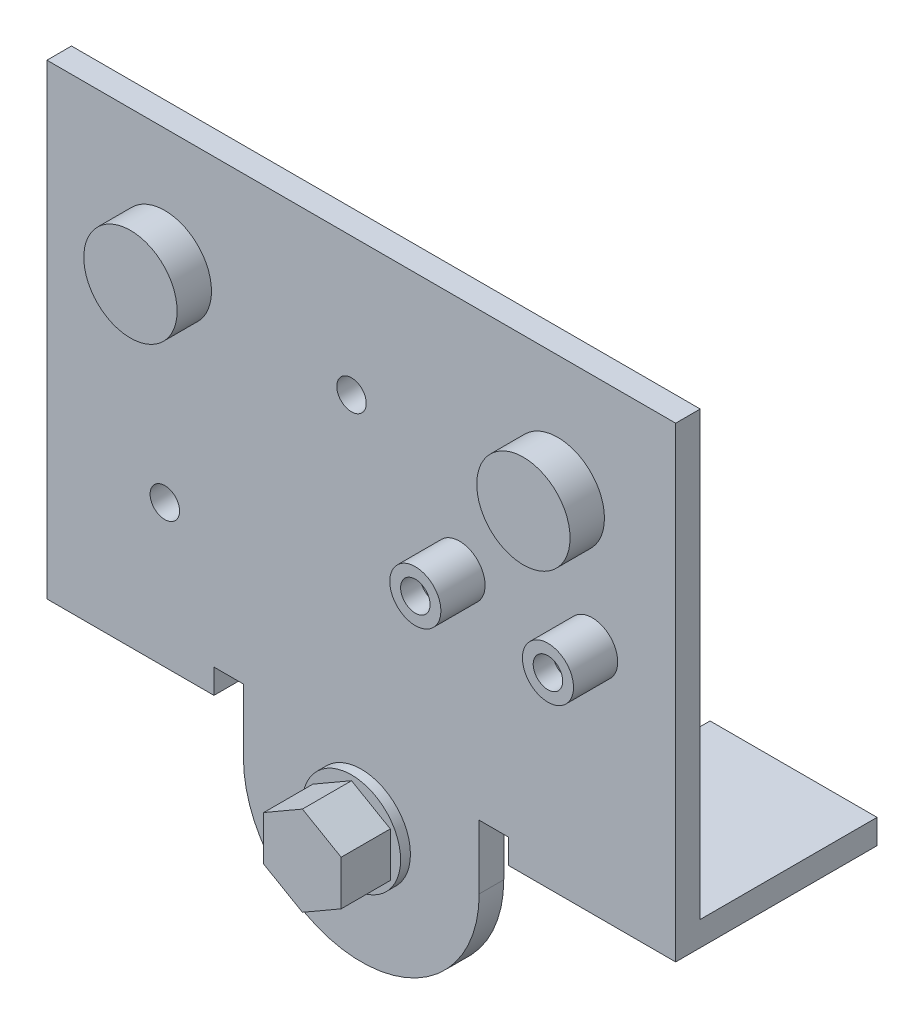
ISO-10303-21;
HEADER;
FILE_DESCRIPTION(('STEP AP214'),'2;1');
FILE_NAME('part.step','',(''),(''),'','','');
FILE_SCHEMA(('AUTOMOTIVE_DESIGN { 1 0 10303 214 1 1 1 1 }'));
ENDSEC;
DATA;
#1=APPLICATION_CONTEXT('core data for automotive mechanical design processes');
#2=APPLICATION_PROTOCOL_DEFINITION('international standard','automotive_design',2000,#1);
#3=PRODUCT_CONTEXT('',#1,'mechanical');
#4=PRODUCT('Part','Part','',(#3));
#5=PRODUCT_RELATED_PRODUCT_CATEGORY('part','',(#4));
#6=PRODUCT_DEFINITION_FORMATION('','',#4);
#7=PRODUCT_DEFINITION_CONTEXT('part definition',#1,'design');
#8=PRODUCT_DEFINITION('design','',#6,#7);
#9=PRODUCT_DEFINITION_SHAPE('','',#8);
#10=(LENGTH_UNIT() NAMED_UNIT(*) SI_UNIT(.MILLI.,.METRE.));
#11=(NAMED_UNIT(*) PLANE_ANGLE_UNIT() SI_UNIT($,.RADIAN.));
#12=(NAMED_UNIT(*) SI_UNIT($,.STERADIAN.) SOLID_ANGLE_UNIT());
#13=UNCERTAINTY_MEASURE_WITH_UNIT(LENGTH_MEASURE(1.E-05),#10,'distance_accuracy_value','');
#14=(GEOMETRIC_REPRESENTATION_CONTEXT(3) GLOBAL_UNCERTAINTY_ASSIGNED_CONTEXT((#13)) GLOBAL_UNIT_ASSIGNED_CONTEXT((#10,
#11,#12)) REPRESENTATION_CONTEXT('',''));
#15=CARTESIAN_POINT('',(0.,0.,0.));
#16=DIRECTION('',(0.,0.,1.));
#17=DIRECTION('',(1.,0.,0.));
#18=AXIS2_PLACEMENT_3D('',#15,#16,#17);
#19=CARTESIAN_POINT('',(-32.,-25.1480637813212,2.5));
#20=DIRECTION('',(0.,1.,0.));
#21=DIRECTION('',(0.,0.,1.));
#22=AXIS2_PLACEMENT_3D('',#19,#20,#21);
#23=PLANE('',#22);
#24=DIRECTION('',(1.,0.,0.));
#25=VECTOR('',#24,1.);
#26=CARTESIAN_POINT('',(-32.,-25.1480637813212,2.5));
#27=LINE('',#26,#25);
#28=CARTESIAN_POINT('',(12.,-25.1480637813212,2.5));
#29=VERTEX_POINT('',#28);
#30=CARTESIAN_POINT('',(15.,-25.1480637813212,2.5));
#31=VERTEX_POINT('',#30);
#32=EDGE_CURVE('E297',#29,#31,#27,.T.);
#33=ORIENTED_EDGE('',*,*,#32,.F.);
#34=DIRECTION('',(0.,0.,1.));
#35=VECTOR('',#34,1.);
#36=CARTESIAN_POINT('',(12.,-25.1480637813212,0.));
#37=LINE('',#36,#35);
#38=CARTESIAN_POINT('',(12.,-25.1480637813212,0.));
#39=VERTEX_POINT('',#38);
#40=EDGE_CURVE('E235',#39,#29,#37,.T.);
#41=ORIENTED_EDGE('',*,*,#40,.F.);
#42=DIRECTION('',(1.,0.,0.));
#43=VECTOR('',#42,1.);
#44=CARTESIAN_POINT('',(-32.,-25.1480637813212,0.));
#45=LINE('',#44,#43);
#46=CARTESIAN_POINT('',(15.,-25.1480637813212,0.));
#47=VERTEX_POINT('',#46);
#48=EDGE_CURVE('E315',#39,#47,#45,.T.);
#49=ORIENTED_EDGE('',*,*,#48,.T.);
#50=DIRECTION('',(0.,0.,-1.));
#51=VECTOR('',#50,1.);
#52=CARTESIAN_POINT('',(15.,-25.1480637813212,2.5));
#53=LINE('',#52,#51);
#54=EDGE_CURVE('E258',#31,#47,#53,.T.);
#55=ORIENTED_EDGE('',*,*,#54,.F.);
#56=EDGE_LOOP('',(#33,#41,#49,#55));
#57=FACE_BOUND('',#56,.T.);
#58=ADVANCED_FACE('F40',(#57),#23,.F.);
#59=CARTESIAN_POINT('',(-15.,-25.1480637813212,0.));
#60=VERTEX_POINT('',#59);
#61=CARTESIAN_POINT('',(-12.,-25.1480637813212,0.));
#62=VERTEX_POINT('',#61);
#63=EDGE_CURVE('E314',#60,#62,#45,.T.);
#64=ORIENTED_EDGE('',*,*,#63,.T.);
#65=DIRECTION('',(0.,0.,1.));
#66=VECTOR('',#65,1.);
#67=CARTESIAN_POINT('',(-12.,-25.1480637813212,0.));
#68=LINE('',#67,#66);
#69=CARTESIAN_POINT('',(-12.,-25.1480637813212,2.5));
#70=VERTEX_POINT('',#69);
#71=EDGE_CURVE('E227',#62,#70,#68,.T.);
#72=ORIENTED_EDGE('',*,*,#71,.T.);
#73=CARTESIAN_POINT('',(-15.,-25.1480637813212,2.5));
#74=VERTEX_POINT('',#73);
#75=EDGE_CURVE('E299',#74,#70,#27,.T.);
#76=ORIENTED_EDGE('',*,*,#75,.F.);
#77=DIRECTION('',(0.,0.,1.));
#78=VECTOR('',#77,1.);
#79=CARTESIAN_POINT('',(-15.,-25.1480637813212,2.5));
#80=LINE('',#79,#78);
#81=EDGE_CURVE('E11',#60,#74,#80,.T.);
#82=ORIENTED_EDGE('',*,*,#81,.F.);
#83=EDGE_LOOP('',(#64,#72,#76,#82));
#84=FACE_BOUND('',#83,.T.);
#85=ADVANCED_FACE('F370',(#84),#23,.F.);
#86=CARTESIAN_POINT('',(-32.,19.8519362186788,2.5));
#87=DIRECTION('',(1.,0.,0.));
#88=DIRECTION('',(0.,1.,0.));
#89=AXIS2_PLACEMENT_3D('',#86,#87,#88);
#90=PLANE('',#89);
#91=DIRECTION('',(0.,-1.,0.));
#92=VECTOR('',#91,1.);
#93=CARTESIAN_POINT('',(-32.,19.8519362186788,0.));
#94=LINE('',#93,#92);
#95=CARTESIAN_POINT('',(-32.,19.8519362186788,0.));
#96=VERTEX_POINT('',#95);
#97=CARTESIAN_POINT('',(-32.,-25.1480637813212,0.));
#98=VERTEX_POINT('',#97);
#99=EDGE_CURVE('E294',#96,#98,#94,.T.);
#100=ORIENTED_EDGE('',*,*,#99,.T.);
#101=DIRECTION('',(0.,0.,-1.));
#102=VECTOR('',#101,1.);
#103=CARTESIAN_POINT('',(-32.,-25.1480637813212,2.5));
#104=LINE('',#103,#102);
#105=CARTESIAN_POINT('',(-32.,-25.1480637813212,-18.));
#106=VERTEX_POINT('',#105);
#107=EDGE_CURVE('E270',#98,#106,#104,.T.);
#108=ORIENTED_EDGE('',*,*,#107,.T.);
#109=DIRECTION('',(0.,1.,0.));
#110=VECTOR('',#109,1.);
#111=CARTESIAN_POINT('',(-32.,-27.6480637813212,-18.));
#112=LINE('',#111,#110);
#113=CARTESIAN_POINT('',(-32.,-27.6480637813212,-18.));
#114=VERTEX_POINT('',#113);
#115=EDGE_CURVE('E291',#114,#106,#112,.T.);
#116=ORIENTED_EDGE('',*,*,#115,.F.);
#117=DIRECTION('',(0.,0.,-1.));
#118=VECTOR('',#117,1.);
#119=CARTESIAN_POINT('',(-32.,-27.6480637813212,2.5));
#120=LINE('',#119,#118);
#121=CARTESIAN_POINT('',(-32.,-27.6480637813212,2.5));
#122=VERTEX_POINT('',#121);
#123=EDGE_CURVE('E271',#122,#114,#120,.T.);
#124=ORIENTED_EDGE('',*,*,#123,.F.);
#125=DIRECTION('',(0.,-1.,0.));
#126=VECTOR('',#125,1.);
#127=CARTESIAN_POINT('',(-32.,19.8519362186788,2.5));
#128=LINE('',#127,#126);
#129=CARTESIAN_POINT('',(-32.,19.8519362186788,2.5));
#130=VERTEX_POINT('',#129);
#131=EDGE_CURVE('E295',#130,#122,#128,.T.);
#132=ORIENTED_EDGE('',*,*,#131,.F.);
#133=DIRECTION('',(0.,0.,-1.));
#134=VECTOR('',#133,1.);
#135=CARTESIAN_POINT('',(-32.,19.8519362186788,2.5));
#136=LINE('',#135,#134);
#137=EDGE_CURVE('E306',#130,#96,#136,.T.);
#138=ORIENTED_EDGE('',*,*,#137,.T.);
#139=EDGE_LOOP('',(#100,#108,#116,#124,#132,#138));
#140=FACE_BOUND('',#139,.T.);
#141=ADVANCED_FACE('F42',(#140),#90,.F.);
#142=CARTESIAN_POINT('',(32.,19.8519362186788,2.5));
#143=DIRECTION('',(-1.,0.,0.));
#144=DIRECTION('',(0.,0.,1.));
#145=AXIS2_PLACEMENT_3D('',#142,#143,#144);
#146=PLANE('',#145);
#147=DIRECTION('',(0.,1.,0.));
#148=VECTOR('',#147,1.);
#149=CARTESIAN_POINT('',(32.,19.8519362186788,0.));
#150=LINE('',#149,#148);
#151=CARTESIAN_POINT('',(32.,-25.1480637813212,0.));
#152=VERTEX_POINT('',#151);
#153=CARTESIAN_POINT('',(32.,19.8519362186788,0.));
#154=VERTEX_POINT('',#153);
#155=EDGE_CURVE('E313',#152,#154,#150,.T.);
#156=ORIENTED_EDGE('',*,*,#155,.T.);
#157=DIRECTION('',(0.,0.,-1.));
#158=VECTOR('',#157,1.);
#159=CARTESIAN_POINT('',(32.,19.8519362186788,2.5));
#160=LINE('',#159,#158);
#161=CARTESIAN_POINT('',(32.,19.8519362186788,2.5));
#162=VERTEX_POINT('',#161);
#163=EDGE_CURVE('E44',#162,#154,#160,.T.);
#164=ORIENTED_EDGE('',*,*,#163,.F.);
#165=DIRECTION('',(0.,1.,0.));
#166=VECTOR('',#165,1.);
#167=CARTESIAN_POINT('',(32.,19.8519362186788,2.5));
#168=LINE('',#167,#166);
#169=CARTESIAN_POINT('',(32.,-27.6480637813212,2.5));
#170=VERTEX_POINT('',#169);
#171=EDGE_CURVE('E302',#170,#162,#168,.T.);
#172=ORIENTED_EDGE('',*,*,#171,.F.);
#173=DIRECTION('',(0.,0.,1.));
#174=VECTOR('',#173,1.);
#175=CARTESIAN_POINT('',(32.,-27.6480637813212,2.5));
#176=LINE('',#175,#174);
#177=CARTESIAN_POINT('',(32.,-27.6480637813212,-18.));
#178=VERTEX_POINT('',#177);
#179=EDGE_CURVE('E244',#178,#170,#176,.T.);
#180=ORIENTED_EDGE('',*,*,#179,.F.);
#181=DIRECTION('',(0.,1.,0.));
#182=VECTOR('',#181,1.);
#183=CARTESIAN_POINT('',(32.,-27.6480637813212,-18.));
#184=LINE('',#183,#182);
#185=CARTESIAN_POINT('',(32.,-25.1480637813212,-18.));
#186=VERTEX_POINT('',#185);
#187=EDGE_CURVE('E254',#178,#186,#184,.T.);
#188=ORIENTED_EDGE('',*,*,#187,.T.);
#189=DIRECTION('',(0.,0.,1.));
#190=VECTOR('',#189,1.);
#191=CARTESIAN_POINT('',(32.,-25.1480637813212,2.5));
#192=LINE('',#191,#190);
#193=EDGE_CURVE('E238',#186,#152,#192,.T.);
#194=ORIENTED_EDGE('',*,*,#193,.T.);
#195=EDGE_LOOP('',(#156,#164,#172,#180,#188,#194));
#196=FACE_BOUND('',#195,.T.);
#197=ADVANCED_FACE('F354',(#196),#146,.F.);
#198=CARTESIAN_POINT('',(-32.,19.8519362186788,2.5));
#199=DIRECTION('',(0.,-1.,0.));
#200=DIRECTION('',(0.,0.,-1.));
#201=AXIS2_PLACEMENT_3D('',#198,#199,#200);
#202=PLANE('',#201);
#203=DIRECTION('',(-1.,0.,0.));
#204=VECTOR('',#203,1.);
#205=CARTESIAN_POINT('',(-32.,19.8519362186788,0.));
#206=LINE('',#205,#204);
#207=EDGE_CURVE('E298',#154,#96,#206,.T.);
#208=ORIENTED_EDGE('',*,*,#207,.T.);
#209=ORIENTED_EDGE('',*,*,#137,.F.);
#210=DIRECTION('',(-1.,0.,0.));
#211=VECTOR('',#210,1.);
#212=CARTESIAN_POINT('',(-32.,19.8519362186788,2.5));
#213=LINE('',#212,#211);
#214=EDGE_CURVE('E304',#162,#130,#213,.T.);
#215=ORIENTED_EDGE('',*,*,#214,.F.);
#216=ORIENTED_EDGE('',*,*,#163,.T.);
#217=EDGE_LOOP('',(#208,#209,#215,#216));
#218=FACE_BOUND('',#217,.T.);
#219=ADVANCED_FACE('F327',(#218),#202,.F.);
#220=CARTESIAN_POINT('',(0.,0.,2.5));
#221=DIRECTION('',(0.,0.,1.));
#222=DIRECTION('',(1.,0.,0.));
#223=AXIS2_PLACEMENT_3D('',#220,#221,#222);
#224=PLANE('',#223);
#225=CARTESIAN_POINT('',(23.5,-4.1480637813212,2.5));
#226=DIRECTION('',(0.,0.,1.));
#227=DIRECTION('',(1.,0.,0.));
#228=AXIS2_PLACEMENT_3D('',#225,#226,#227);
#229=CIRCLE('',#228,2.6);
#230=CARTESIAN_POINT('',(26.1,-4.1480637813212,2.5));
#231=VERTEX_POINT('',#230);
#232=EDGE_CURVE('E412',#231,#231,#229,.T.);
#233=ORIENTED_EDGE('',*,*,#232,.F.);
#234=EDGE_LOOP('',(#233));
#235=FACE_BOUND('',#234,.T.);
#236=CARTESIAN_POINT('',(9.99999999999999,-4.1480637813212,2.5));
#237=DIRECTION('',(0.,0.,1.));
#238=DIRECTION('',(1.,0.,0.));
#239=AXIS2_PLACEMENT_3D('',#236,#237,#238);
#240=CIRCLE('',#239,2.6);
#241=CARTESIAN_POINT('',(12.6,-4.1480637813212,2.5));
#242=VERTEX_POINT('',#241);
#243=EDGE_CURVE('E416',#242,#242,#240,.T.);
#244=ORIENTED_EDGE('',*,*,#243,.F.);
#245=EDGE_LOOP('',(#244));
#246=FACE_BOUND('',#245,.T.);
#247=CARTESIAN_POINT('',(20.,7.8519362186788,2.5));
#248=DIRECTION('',(0.,0.,1.));
#249=DIRECTION('',(1.,0.,0.));
#250=AXIS2_PLACEMENT_3D('',#247,#248,#249);
#251=CIRCLE('',#250,4.75);
#252=CARTESIAN_POINT('',(24.75,7.8519362186788,2.5));
#253=VERTEX_POINT('',#252);
#254=EDGE_CURVE('E420',#253,#253,#251,.T.);
#255=ORIENTED_EDGE('',*,*,#254,.F.);
#256=EDGE_LOOP('',(#255));
#257=FACE_BOUND('',#256,.T.);
#258=CARTESIAN_POINT('',(-20.,7.8519362186788,2.5));
#259=DIRECTION('',(0.,0.,1.));
#260=DIRECTION('',(1.,0.,0.));
#261=AXIS2_PLACEMENT_3D('',#258,#259,#260);
#262=CIRCLE('',#261,4.75);
#263=CARTESIAN_POINT('',(-15.25,7.8519362186788,2.5));
#264=VERTEX_POINT('',#263);
#265=EDGE_CURVE('E424',#264,#264,#262,.T.);
#266=ORIENTED_EDGE('',*,*,#265,.F.);
#267=EDGE_LOOP('',(#266));
#268=FACE_BOUND('',#267,.T.);
#269=CARTESIAN_POINT('',(-20.,-13.1480637813212,2.5));
#270=DIRECTION('',(0.,0.,1.));
#271=DIRECTION('',(1.,0.,0.));
#272=AXIS2_PLACEMENT_3D('',#269,#270,#271);
#273=CIRCLE('',#272,1.5);
#274=CARTESIAN_POINT('',(-18.5,-13.1480637813212,2.5));
#275=VERTEX_POINT('',#274);
#276=EDGE_CURVE('E428',#275,#275,#273,.T.);
#277=ORIENTED_EDGE('',*,*,#276,.F.);
#278=EDGE_LOOP('',(#277));
#279=FACE_BOUND('',#278,.T.);
#280=CARTESIAN_POINT('',(-1.00000000000001,5.8519362186788,2.5));
#281=DIRECTION('',(0.,0.,1.));
#282=DIRECTION('',(1.,0.,0.));
#283=AXIS2_PLACEMENT_3D('',#280,#281,#282);
#284=CIRCLE('',#283,1.5);
#285=CARTESIAN_POINT('',(0.499999999999992,5.8519362186788,2.5));
#286=VERTEX_POINT('',#285);
#287=EDGE_CURVE('E432',#286,#286,#284,.T.);
#288=ORIENTED_EDGE('',*,*,#287,.F.);
#289=EDGE_LOOP('',(#288));
#290=FACE_BOUND('',#289,.T.);
#291=CARTESIAN_POINT('',(0.,-31.6480637813212,2.5));
#292=DIRECTION('',(0.,0.,1.));
#293=DIRECTION('',(1.,0.,0.));
#294=AXIS2_PLACEMENT_3D('',#291,#292,#293);
#295=CIRCLE('',#294,5.);
#296=CARTESIAN_POINT('',(5.,-31.6480637813212,2.5));
#297=VERTEX_POINT('',#296);
#298=EDGE_CURVE('E205',#297,#297,#295,.T.);
#299=ORIENTED_EDGE('',*,*,#298,.F.);
#300=EDGE_LOOP('',(#299));
#301=FACE_BOUND('',#300,.T.);
#302=ORIENTED_EDGE('',*,*,#131,.T.);
#303=DIRECTION('',(-1.,0.,0.));
#304=VECTOR('',#303,1.);
#305=CARTESIAN_POINT('',(-32.,-27.6480637813212,2.5));
#306=LINE('',#305,#304);
#307=CARTESIAN_POINT('',(-15.,-27.6480637813212,2.5));
#308=VERTEX_POINT('',#307);
#309=EDGE_CURVE('E278',#308,#122,#306,.T.);
#310=ORIENTED_EDGE('',*,*,#309,.F.);
#311=DIRECTION('',(0.,1.,0.));
#312=VECTOR('',#311,1.);
#313=CARTESIAN_POINT('',(-15.,-27.6480637813212,2.5));
#314=LINE('',#313,#312);
#315=EDGE_CURVE('E281',#308,#74,#314,.T.);
#316=ORIENTED_EDGE('',*,*,#315,.T.);
#317=ORIENTED_EDGE('',*,*,#75,.T.);
#318=DIRECTION('',(0.,-1.,0.));
#319=VECTOR('',#318,1.);
#320=CARTESIAN_POINT('',(-12.,-25.1480637813212,2.5));
#321=LINE('',#320,#319);
#322=CARTESIAN_POINT('',(-12.,-31.6480637813212,2.5));
#323=VERTEX_POINT('',#322);
#324=EDGE_CURVE('E215',#70,#323,#321,.T.);
#325=ORIENTED_EDGE('',*,*,#324,.T.);
#326=CARTESIAN_POINT('',(0.,-31.6480637813212,2.5));
#327=DIRECTION('',(0.,0.,1.));
#328=DIRECTION('',(-1.,0.,0.));
#329=AXIS2_PLACEMENT_3D('',#326,#327,#328);
#330=CIRCLE('',#329,12.);
#331=CARTESIAN_POINT('',(12.,-31.6480637813212,2.5));
#332=VERTEX_POINT('',#331);
#333=EDGE_CURVE('E230',#323,#332,#330,.T.);
#334=ORIENTED_EDGE('',*,*,#333,.T.);
#335=DIRECTION('',(0.,1.,0.));
#336=VECTOR('',#335,1.);
#337=CARTESIAN_POINT('',(12.,-25.1480637813212,2.5));
#338=LINE('',#337,#336);
#339=EDGE_CURVE('E221',#332,#29,#338,.T.);
#340=ORIENTED_EDGE('',*,*,#339,.T.);
#341=ORIENTED_EDGE('',*,*,#32,.T.);
#342=DIRECTION('',(0.,1.,0.));
#343=VECTOR('',#342,1.);
#344=CARTESIAN_POINT('',(15.,-27.6480637813212,2.5));
#345=LINE('',#344,#343);
#346=CARTESIAN_POINT('',(15.,-27.6480637813212,2.5));
#347=VERTEX_POINT('',#346);
#348=EDGE_CURVE('E267',#347,#31,#345,.T.);
#349=ORIENTED_EDGE('',*,*,#348,.F.);
#350=DIRECTION('',(-1.,0.,0.));
#351=VECTOR('',#350,1.);
#352=CARTESIAN_POINT('',(32.,-27.6480637813212,2.5));
#353=LINE('',#352,#351);
#354=EDGE_CURVE('E247',#170,#347,#353,.T.);
#355=ORIENTED_EDGE('',*,*,#354,.F.);
#356=ORIENTED_EDGE('',*,*,#171,.T.);
#357=ORIENTED_EDGE('',*,*,#214,.T.);
#358=EDGE_LOOP('',(#302,#310,#316,#317,#325,#334,#340,#341,#349,#355,#356,#357));
#359=FACE_BOUND('',#358,.T.);
#360=ADVANCED_FACE('F350',(#235,#246,#257,#268,#279,#290,#301,#359),#224,.T.);
#361=CARTESIAN_POINT('',(0.,0.,0.));
#362=DIRECTION('',(0.,0.,1.));
#363=DIRECTION('',(1.,0.,0.));
#364=AXIS2_PLACEMENT_3D('',#361,#362,#363);
#365=PLANE('',#364);
#366=CARTESIAN_POINT('',(-20.,-13.1480637813212,0.));
#367=DIRECTION('',(0.,0.,1.));
#368=DIRECTION('',(1.,0.,0.));
#369=AXIS2_PLACEMENT_3D('',#366,#367,#368);
#370=CIRCLE('',#369,1.5);
#371=CARTESIAN_POINT('',(-18.5,-13.1480637813212,0.));
#372=VERTEX_POINT('',#371);
#373=EDGE_CURVE('E795',#372,#372,#370,.T.);
#374=ORIENTED_EDGE('',*,*,#373,.T.);
#375=EDGE_LOOP('',(#374));
#376=FACE_BOUND('',#375,.T.);
#377=CARTESIAN_POINT('',(-1.00000000000001,5.8519362186788,0.));
#378=DIRECTION('',(0.,0.,1.));
#379=DIRECTION('',(1.,0.,0.));
#380=AXIS2_PLACEMENT_3D('',#377,#378,#379);
#381=CIRCLE('',#380,1.5);
#382=CARTESIAN_POINT('',(0.499999999999992,5.8519362186788,0.));
#383=VERTEX_POINT('',#382);
#384=EDGE_CURVE('E799',#383,#383,#381,.T.);
#385=ORIENTED_EDGE('',*,*,#384,.T.);
#386=EDGE_LOOP('',(#385));
#387=FACE_BOUND('',#386,.T.);
#388=ORIENTED_EDGE('',*,*,#99,.F.);
#389=ORIENTED_EDGE('',*,*,#207,.F.);
#390=ORIENTED_EDGE('',*,*,#155,.F.);
#391=EDGE_CURVE('E309',#47,#152,#45,.T.);
#392=ORIENTED_EDGE('',*,*,#391,.F.);
#393=ORIENTED_EDGE('',*,*,#48,.F.);
#394=DIRECTION('',(0.,1.,0.));
#395=VECTOR('',#394,1.);
#396=CARTESIAN_POINT('',(12.,-25.1480637813212,0.));
#397=LINE('',#396,#395);
#398=CARTESIAN_POINT('',(12.,-31.6480637813212,0.));
#399=VERTEX_POINT('',#398);
#400=EDGE_CURVE('E224',#399,#39,#397,.T.);
#401=ORIENTED_EDGE('',*,*,#400,.F.);
#402=CARTESIAN_POINT('',(0.,-31.6480637813212,0.));
#403=DIRECTION('',(0.,0.,1.));
#404=DIRECTION('',(-1.,0.,0.));
#405=AXIS2_PLACEMENT_3D('',#402,#403,#404);
#406=CIRCLE('',#405,12.);
#407=CARTESIAN_POINT('',(-12.,-31.6480637813212,0.));
#408=VERTEX_POINT('',#407);
#409=EDGE_CURVE('E220',#408,#399,#406,.T.);
#410=ORIENTED_EDGE('',*,*,#409,.F.);
#411=DIRECTION('',(0.,-1.,0.));
#412=VECTOR('',#411,1.);
#413=CARTESIAN_POINT('',(-12.,-25.1480637813212,0.));
#414=LINE('',#413,#412);
#415=EDGE_CURVE('E217',#62,#408,#414,.T.);
#416=ORIENTED_EDGE('',*,*,#415,.F.);
#417=ORIENTED_EDGE('',*,*,#63,.F.);
#418=EDGE_CURVE('E310',#98,#60,#45,.T.);
#419=ORIENTED_EDGE('',*,*,#418,.F.);
#420=EDGE_LOOP('',(#388,#389,#390,#392,#393,#401,#410,#416,#417,#419));
#421=FACE_BOUND('',#420,.T.);
#422=ADVANCED_FACE('F330',(#376,#387,#421),#365,.F.);
#423=CARTESIAN_POINT('',(0.,-25.1480637813212,0.));
#424=DIRECTION('',(0.,-1.,0.));
#425=DIRECTION('',(0.,0.,-1.));
#426=AXIS2_PLACEMENT_3D('',#423,#424,#425);
#427=PLANE('',#426);
#428=ORIENTED_EDGE('',*,*,#107,.F.);
#429=ORIENTED_EDGE('',*,*,#418,.T.);
#430=CARTESIAN_POINT('',(-15.,-25.1480637813212,-18.));
#431=VERTEX_POINT('',#430);
#432=EDGE_CURVE('E50',#431,#60,#80,.T.);
#433=ORIENTED_EDGE('',*,*,#432,.F.);
#434=DIRECTION('',(1.,0.,0.));
#435=VECTOR('',#434,1.);
#436=CARTESIAN_POINT('',(-32.,-25.1480637813212,-18.));
#437=LINE('',#436,#435);
#438=EDGE_CURVE('E283',#106,#431,#437,.T.);
#439=ORIENTED_EDGE('',*,*,#438,.F.);
#440=EDGE_LOOP('',(#428,#429,#433,#439));
#441=FACE_BOUND('',#440,.T.);
#442=ADVANCED_FACE('F338',(#441),#427,.F.);
#443=CARTESIAN_POINT('',(-32.,-27.6480637813212,-18.));
#444=DIRECTION('',(0.,0.,1.));
#445=DIRECTION('',(1.,0.,0.));
#446=AXIS2_PLACEMENT_3D('',#443,#444,#445);
#447=PLANE('',#446);
#448=ORIENTED_EDGE('',*,*,#438,.T.);
#449=DIRECTION('',(0.,1.,0.));
#450=VECTOR('',#449,1.);
#451=CARTESIAN_POINT('',(-15.,-27.6480637813212,-18.));
#452=LINE('',#451,#450);
#453=CARTESIAN_POINT('',(-15.,-27.6480637813212,-18.));
#454=VERTEX_POINT('',#453);
#455=EDGE_CURVE('E288',#454,#431,#452,.T.);
#456=ORIENTED_EDGE('',*,*,#455,.F.);
#457=DIRECTION('',(1.,0.,0.));
#458=VECTOR('',#457,1.);
#459=CARTESIAN_POINT('',(-32.,-27.6480637813212,-18.));
#460=LINE('',#459,#458);
#461=EDGE_CURVE('E274',#114,#454,#460,.T.);
#462=ORIENTED_EDGE('',*,*,#461,.F.);
#463=ORIENTED_EDGE('',*,*,#115,.T.);
#464=EDGE_LOOP('',(#448,#456,#462,#463));
#465=FACE_BOUND('',#464,.T.);
#466=ADVANCED_FACE('F342',(#465),#447,.F.);
#467=CARTESIAN_POINT('',(-15.,-27.6480637813212,2.5));
#468=DIRECTION('',(-1.,0.,0.));
#469=DIRECTION('',(0.,0.,1.));
#470=AXIS2_PLACEMENT_3D('',#467,#468,#469);
#471=PLANE('',#470);
#472=ORIENTED_EDGE('',*,*,#432,.T.);
#473=ORIENTED_EDGE('',*,*,#81,.T.);
#474=ORIENTED_EDGE('',*,*,#315,.F.);
#475=DIRECTION('',(0.,0.,1.));
#476=VECTOR('',#475,1.);
#477=CARTESIAN_POINT('',(-15.,-27.6480637813212,2.5));
#478=LINE('',#477,#476);
#479=EDGE_CURVE('E276',#454,#308,#478,.T.);
#480=ORIENTED_EDGE('',*,*,#479,.F.);
#481=ORIENTED_EDGE('',*,*,#455,.T.);
#482=EDGE_LOOP('',(#472,#473,#474,#480,#481));
#483=FACE_BOUND('',#482,.T.);
#484=ADVANCED_FACE('F382',(#483),#471,.F.);
#485=CARTESIAN_POINT('',(0.,-27.6480637813212,0.));
#486=DIRECTION('',(0.,-1.,0.));
#487=DIRECTION('',(0.,0.,-1.));
#488=AXIS2_PLACEMENT_3D('',#485,#486,#487);
#489=PLANE('',#488);
#490=ORIENTED_EDGE('',*,*,#123,.T.);
#491=ORIENTED_EDGE('',*,*,#461,.T.);
#492=ORIENTED_EDGE('',*,*,#479,.T.);
#493=ORIENTED_EDGE('',*,*,#309,.T.);
#494=EDGE_LOOP('',(#490,#491,#492,#493));
#495=FACE_BOUND('',#494,.T.);
#496=ADVANCED_FACE('F345',(#495),#489,.T.);
#497=CARTESIAN_POINT('',(0.,-25.1480637813212,0.));
#498=DIRECTION('',(0.,1.,0.));
#499=DIRECTION('',(0.,0.,1.));
#500=AXIS2_PLACEMENT_3D('',#497,#498,#499);
#501=PLANE('',#500);
#502=ORIENTED_EDGE('',*,*,#391,.T.);
#503=ORIENTED_EDGE('',*,*,#193,.F.);
#504=DIRECTION('',(1.,0.,0.));
#505=VECTOR('',#504,1.);
#506=CARTESIAN_POINT('',(32.,-25.1480637813212,-18.));
#507=LINE('',#506,#505);
#508=CARTESIAN_POINT('',(15.,-25.1480637813212,-18.));
#509=VERTEX_POINT('',#508);
#510=EDGE_CURVE('E248',#509,#186,#507,.T.);
#511=ORIENTED_EDGE('',*,*,#510,.F.);
#512=EDGE_CURVE('E257',#47,#509,#53,.T.);
#513=ORIENTED_EDGE('',*,*,#512,.F.);
#514=EDGE_LOOP('',(#502,#503,#511,#513));
#515=FACE_BOUND('',#514,.T.);
#516=ADVANCED_FACE('F367',(#515),#501,.T.);
#517=CARTESIAN_POINT('',(15.,-27.6480637813212,2.5));
#518=DIRECTION('',(1.,0.,0.));
#519=DIRECTION('',(0.,0.,-1.));
#520=AXIS2_PLACEMENT_3D('',#517,#518,#519);
#521=PLANE('',#520);
#522=ORIENTED_EDGE('',*,*,#54,.T.);
#523=ORIENTED_EDGE('',*,*,#512,.T.);
#524=DIRECTION('',(0.,1.,0.));
#525=VECTOR('',#524,1.);
#526=CARTESIAN_POINT('',(15.,-27.6480637813212,-18.));
#527=LINE('',#526,#525);
#528=CARTESIAN_POINT('',(15.,-27.6480637813212,-18.));
#529=VERTEX_POINT('',#528);
#530=EDGE_CURVE('E264',#529,#509,#527,.T.);
#531=ORIENTED_EDGE('',*,*,#530,.F.);
#532=DIRECTION('',(0.,0.,-1.));
#533=VECTOR('',#532,1.);
#534=CARTESIAN_POINT('',(15.,-27.6480637813212,2.5));
#535=LINE('',#534,#533);
#536=EDGE_CURVE('E250',#347,#529,#535,.T.);
#537=ORIENTED_EDGE('',*,*,#536,.F.);
#538=ORIENTED_EDGE('',*,*,#348,.T.);
#539=EDGE_LOOP('',(#522,#523,#531,#537,#538));
#540=FACE_BOUND('',#539,.T.);
#541=ADVANCED_FACE('F459',(#540),#521,.F.);
#542=CARTESIAN_POINT('',(32.,-27.6480637813212,-18.));
#543=DIRECTION('',(0.,0.,1.));
#544=DIRECTION('',(1.,0.,0.));
#545=AXIS2_PLACEMENT_3D('',#542,#543,#544);
#546=PLANE('',#545);
#547=ORIENTED_EDGE('',*,*,#510,.T.);
#548=ORIENTED_EDGE('',*,*,#187,.F.);
#549=DIRECTION('',(1.,0.,0.));
#550=VECTOR('',#549,1.);
#551=CARTESIAN_POINT('',(32.,-27.6480637813212,-18.));
#552=LINE('',#551,#550);
#553=EDGE_CURVE('E252',#529,#178,#552,.T.);
#554=ORIENTED_EDGE('',*,*,#553,.F.);
#555=ORIENTED_EDGE('',*,*,#530,.T.);
#556=EDGE_LOOP('',(#547,#548,#554,#555));
#557=FACE_BOUND('',#556,.T.);
#558=ADVANCED_FACE('F363',(#557),#546,.F.);
#559=CARTESIAN_POINT('',(0.,-27.6480637813212,0.));
#560=DIRECTION('',(0.,1.,0.));
#561=DIRECTION('',(0.,0.,1.));
#562=AXIS2_PLACEMENT_3D('',#559,#560,#561);
#563=PLANE('',#562);
#564=ORIENTED_EDGE('',*,*,#179,.T.);
#565=ORIENTED_EDGE('',*,*,#354,.T.);
#566=ORIENTED_EDGE('',*,*,#536,.T.);
#567=ORIENTED_EDGE('',*,*,#553,.T.);
#568=EDGE_LOOP('',(#564,#565,#566,#567));
#569=FACE_BOUND('',#568,.T.);
#570=ADVANCED_FACE('F358',(#569),#563,.F.);
#571=CARTESIAN_POINT('',(12.,-25.1480637813212,0.));
#572=DIRECTION('',(1.,0.,0.));
#573=DIRECTION('',(0.,1.,0.));
#574=AXIS2_PLACEMENT_3D('',#571,#572,#573);
#575=PLANE('',#574);
#576=ORIENTED_EDGE('',*,*,#339,.F.);
#577=DIRECTION('',(0.,0.,1.));
#578=VECTOR('',#577,1.);
#579=CARTESIAN_POINT('',(12.,-31.6480637813212,0.));
#580=LINE('',#579,#578);
#581=EDGE_CURVE('E239',#399,#332,#580,.T.);
#582=ORIENTED_EDGE('',*,*,#581,.F.);
#583=ORIENTED_EDGE('',*,*,#400,.T.);
#584=ORIENTED_EDGE('',*,*,#40,.T.);
#585=EDGE_LOOP('',(#576,#582,#583,#584));
#586=FACE_BOUND('',#585,.T.);
#587=ADVANCED_FACE('F449',(#586),#575,.T.);
#588=CARTESIAN_POINT('',(0.,-31.6480637813212,0.));
#589=DIRECTION('',(0.,0.,1.));
#590=DIRECTION('',(1.,0.,0.));
#591=AXIS2_PLACEMENT_3D('',#588,#589,#590);
#592=CYLINDRICAL_SURFACE('',#591,12.);
#593=ORIENTED_EDGE('',*,*,#333,.F.);
#594=DIRECTION('',(0.,0.,1.));
#595=VECTOR('',#594,1.);
#596=CARTESIAN_POINT('',(-12.,-31.6480637813212,0.));
#597=LINE('',#596,#595);
#598=EDGE_CURVE('E241',#408,#323,#597,.T.);
#599=ORIENTED_EDGE('',*,*,#598,.F.);
#600=ORIENTED_EDGE('',*,*,#409,.T.);
#601=ORIENTED_EDGE('',*,*,#581,.T.);
#602=EDGE_LOOP('',(#593,#599,#600,#601));
#603=FACE_BOUND('',#602,.T.);
#604=ADVANCED_FACE('F379',(#603),#592,.T.);
#605=CARTESIAN_POINT('',(-12.,-25.1480637813212,0.));
#606=DIRECTION('',(-1.,0.,0.));
#607=DIRECTION('',(0.,0.,1.));
#608=AXIS2_PLACEMENT_3D('',#605,#606,#607);
#609=PLANE('',#608);
#610=ORIENTED_EDGE('',*,*,#324,.F.);
#611=ORIENTED_EDGE('',*,*,#71,.F.);
#612=ORIENTED_EDGE('',*,*,#415,.T.);
#613=ORIENTED_EDGE('',*,*,#598,.T.);
#614=EDGE_LOOP('',(#610,#611,#612,#613));
#615=FACE_BOUND('',#614,.T.);
#616=ADVANCED_FACE('F374',(#615),#609,.T.);
#617=CARTESIAN_POINT('',(0.,-31.6480637813212,3.5));
#618=DIRECTION('',(0.,0.,-1.));
#619=DIRECTION('',(-1.,0.,0.));
#620=AXIS2_PLACEMENT_3D('',#617,#618,#619);
#621=CYLINDRICAL_SURFACE('',#620,5.);
#622=CARTESIAN_POINT('',(0.,-31.6480637813212,3.5));
#623=DIRECTION('',(0.,0.,1.));
#624=DIRECTION('',(1.,0.,0.));
#625=AXIS2_PLACEMENT_3D('',#622,#623,#624);
#626=CIRCLE('',#625,5.);
#627=CARTESIAN_POINT('',(5.,-31.6480637813212,3.5));
#628=VERTEX_POINT('',#627);
#629=EDGE_CURVE('E208',#628,#628,#626,.T.);
#630=ORIENTED_EDGE('',*,*,#629,.F.);
#631=EDGE_LOOP('',(#630));
#632=FACE_BOUND('',#631,.T.);
#633=ORIENTED_EDGE('',*,*,#298,.T.);
#634=EDGE_LOOP('',(#633));
#635=FACE_BOUND('',#634,.T.);
#636=ADVANCED_FACE('F435',(#632,#635),#621,.T.);
#637=CARTESIAN_POINT('',(0.,-31.6480637813212,3.5));
#638=DIRECTION('',(0.,0.,1.));
#639=DIRECTION('',(1.,0.,0.));
#640=AXIS2_PLACEMENT_3D('',#637,#638,#639);
#641=PLANE('',#640);
#642=DIRECTION('',(-0.866025403784439,0.5,0.));
#643=VECTOR('',#642,1.);
#644=CARTESIAN_POINT('',(0.00767228344194615,-27.1643334487017,3.5));
#645=LINE('',#644,#643);
#646=CARTESIAN_POINT('',(3.94871679176528,-29.4396965564705,3.5));
#647=VERTEX_POINT('',#646);
#648=CARTESIAN_POINT('',(0.00767228344194615,-27.1643334487017,3.5));
#649=VERTEX_POINT('',#648);
#650=EDGE_CURVE('E57',#647,#649,#645,.T.);
#651=ORIENTED_EDGE('',*,*,#650,.F.);
#652=DIRECTION('',(0.,1.,0.));
#653=VECTOR('',#652,1.);
#654=CARTESIAN_POINT('',(3.94871679176528,-29.4396965564705,3.5));
#655=LINE('',#654,#653);
#656=CARTESIAN_POINT('',(3.94871679176528,-33.990422772008,3.5));
#657=VERTEX_POINT('',#656);
#658=EDGE_CURVE('E61',#657,#647,#655,.T.);
#659=ORIENTED_EDGE('',*,*,#658,.F.);
#660=DIRECTION('',(0.866025403784438,0.5,0.));
#661=VECTOR('',#660,1.);
#662=CARTESIAN_POINT('',(3.94871679176528,-33.990422772008,3.5));
#663=LINE('',#662,#661);
#664=CARTESIAN_POINT('',(0.00767228344191514,-36.2657858797768,3.5));
#665=VERTEX_POINT('',#664);
#666=EDGE_CURVE('E819',#665,#657,#663,.T.);
#667=ORIENTED_EDGE('',*,*,#666,.F.);
#668=DIRECTION('',(0.866025403784438,-0.5,0.));
#669=VECTOR('',#668,1.);
#670=CARTESIAN_POINT('',(-3.93337222488145,-33.990422772008,3.5));
#671=LINE('',#670,#669);
#672=CARTESIAN_POINT('',(-3.93337222488145,-33.990422772008,3.5));
#673=VERTEX_POINT('',#672);
#674=EDGE_CURVE('E816',#673,#665,#671,.T.);
#675=ORIENTED_EDGE('',*,*,#674,.F.);
#676=DIRECTION('',(0.,-1.,0.));
#677=VECTOR('',#676,1.);
#678=CARTESIAN_POINT('',(-3.93337222488146,-29.4396965564704,3.5));
#679=LINE('',#678,#677);
#680=CARTESIAN_POINT('',(-3.93337222488146,-29.4396965564704,3.5));
#681=VERTEX_POINT('',#680);
#682=EDGE_CURVE('E813',#681,#673,#679,.T.);
#683=ORIENTED_EDGE('',*,*,#682,.F.);
#684=DIRECTION('',(-0.866025403784447,-0.499999999999986,0.));
#685=VECTOR('',#684,1.);
#686=CARTESIAN_POINT('',(0.00767228344194615,-27.1643334487017,3.5));
#687=LINE('',#686,#685);
#688=EDGE_CURVE('E811',#649,#681,#687,.T.);
#689=ORIENTED_EDGE('',*,*,#688,.F.);
#690=EDGE_LOOP('',(#651,#659,#667,#675,#683,#689));
#691=FACE_BOUND('',#690,.T.);
#692=ORIENTED_EDGE('',*,*,#629,.T.);
#693=EDGE_LOOP('',(#692));
#694=FACE_BOUND('',#693,.T.);
#695=ADVANCED_FACE('F437',(#691,#694),#641,.T.);
#696=CARTESIAN_POINT('',(0.00767228344194615,-27.1643334487017,8.5));
#697=DIRECTION('',(-0.5,-0.866025403784439,0.));
#698=DIRECTION('',(0.866025403784439,-0.5,0.));
#699=AXIS2_PLACEMENT_3D('',#696,#697,#698);
#700=PLANE('',#699);
#701=ORIENTED_EDGE('',*,*,#650,.T.);
#702=DIRECTION('',(0.,0.,-1.));
#703=VECTOR('',#702,1.);
#704=CARTESIAN_POINT('',(0.00767228344194615,-27.1643334487017,8.5));
#705=LINE('',#704,#703);
#706=CARTESIAN_POINT('',(0.00767228344194615,-27.1643334487017,8.5));
#707=VERTEX_POINT('',#706);
#708=EDGE_CURVE('E188',#707,#649,#705,.T.);
#709=ORIENTED_EDGE('',*,*,#708,.F.);
#710=DIRECTION('',(-0.866025403784439,0.5,0.));
#711=VECTOR('',#710,1.);
#712=CARTESIAN_POINT('',(0.00767228344194615,-27.1643334487017,8.5));
#713=LINE('',#712,#711);
#714=CARTESIAN_POINT('',(3.94871679176528,-29.4396965564705,8.5));
#715=VERTEX_POINT('',#714);
#716=EDGE_CURVE('E194',#715,#707,#713,.T.);
#717=ORIENTED_EDGE('',*,*,#716,.F.);
#718=DIRECTION('',(0.,0.,-1.));
#719=VECTOR('',#718,1.);
#720=CARTESIAN_POINT('',(3.94871679176528,-29.4396965564705,8.5));
#721=LINE('',#720,#719);
#722=EDGE_CURVE('E809',#715,#647,#721,.T.);
#723=ORIENTED_EDGE('',*,*,#722,.T.);
#724=EDGE_LOOP('',(#701,#709,#717,#723));
#725=FACE_BOUND('',#724,.T.);
#726=ADVANCED_FACE('F204',(#725),#700,.F.);
#727=CARTESIAN_POINT('',(0.00767228344194615,-27.1643334487017,8.5));
#728=DIRECTION('',(0.499999999999986,-0.866025403784447,0.));
#729=DIRECTION('',(0.866025403784447,0.499999999999986,0.));
#730=AXIS2_PLACEMENT_3D('',#727,#728,#729);
#731=PLANE('',#730);
#732=ORIENTED_EDGE('',*,*,#688,.T.);
#733=DIRECTION('',(0.,0.,-1.));
#734=VECTOR('',#733,1.);
#735=CARTESIAN_POINT('',(-3.93337222488146,-29.4396965564704,8.5));
#736=LINE('',#735,#734);
#737=CARTESIAN_POINT('',(-3.93337222488146,-29.4396965564704,8.5));
#738=VERTEX_POINT('',#737);
#739=EDGE_CURVE('E190',#738,#681,#736,.T.);
#740=ORIENTED_EDGE('',*,*,#739,.F.);
#741=DIRECTION('',(-0.866025403784447,-0.499999999999986,0.));
#742=VECTOR('',#741,1.);
#743=CARTESIAN_POINT('',(0.00767228344194615,-27.1643334487017,8.5));
#744=LINE('',#743,#742);
#745=EDGE_CURVE('E183',#707,#738,#744,.T.);
#746=ORIENTED_EDGE('',*,*,#745,.F.);
#747=ORIENTED_EDGE('',*,*,#708,.T.);
#748=EDGE_LOOP('',(#732,#740,#746,#747));
#749=FACE_BOUND('',#748,.T.);
#750=ADVANCED_FACE('F186',(#749),#731,.F.);
#751=CARTESIAN_POINT('',(-3.93337222488146,-29.4396965564704,8.5));
#752=DIRECTION('',(1.,0.,0.));
#753=DIRECTION('',(0.,1.,0.));
#754=AXIS2_PLACEMENT_3D('',#751,#752,#753);
#755=PLANE('',#754);
#756=ORIENTED_EDGE('',*,*,#682,.T.);
#757=DIRECTION('',(0.,0.,-1.));
#758=VECTOR('',#757,1.);
#759=CARTESIAN_POINT('',(-3.93337222488145,-33.990422772008,8.5));
#760=LINE('',#759,#758);
#761=CARTESIAN_POINT('',(-3.93337222488145,-33.990422772008,8.5));
#762=VERTEX_POINT('',#761);
#763=EDGE_CURVE('E210',#762,#673,#760,.T.);
#764=ORIENTED_EDGE('',*,*,#763,.F.);
#765=DIRECTION('',(0.,-1.,0.));
#766=VECTOR('',#765,1.);
#767=CARTESIAN_POINT('',(-3.93337222488146,-29.4396965564704,8.5));
#768=LINE('',#767,#766);
#769=EDGE_CURVE('E193',#738,#762,#768,.T.);
#770=ORIENTED_EDGE('',*,*,#769,.F.);
#771=ORIENTED_EDGE('',*,*,#739,.T.);
#772=EDGE_LOOP('',(#756,#764,#770,#771));
#773=FACE_BOUND('',#772,.T.);
#774=ADVANCED_FACE('F567',(#773),#755,.F.);
#775=CARTESIAN_POINT('',(-3.93337222488145,-33.990422772008,8.5));
#776=DIRECTION('',(0.5,0.866025403784438,0.));
#777=DIRECTION('',(-0.866025403784438,0.5,0.));
#778=AXIS2_PLACEMENT_3D('',#775,#776,#777);
#779=PLANE('',#778);
#780=ORIENTED_EDGE('',*,*,#674,.T.);
#781=DIRECTION('',(0.,0.,-1.));
#782=VECTOR('',#781,1.);
#783=CARTESIAN_POINT('',(0.00767228344191514,-36.2657858797768,8.5));
#784=LINE('',#783,#782);
#785=CARTESIAN_POINT('',(0.00767228344191514,-36.2657858797768,8.5));
#786=VERTEX_POINT('',#785);
#787=EDGE_CURVE('E826',#786,#665,#784,.T.);
#788=ORIENTED_EDGE('',*,*,#787,.F.);
#789=DIRECTION('',(0.866025403784438,-0.5,0.));
#790=VECTOR('',#789,1.);
#791=CARTESIAN_POINT('',(-3.93337222488145,-33.990422772008,8.5));
#792=LINE('',#791,#790);
#793=EDGE_CURVE('E804',#762,#786,#792,.T.);
#794=ORIENTED_EDGE('',*,*,#793,.F.);
#795=ORIENTED_EDGE('',*,*,#763,.T.);
#796=EDGE_LOOP('',(#780,#788,#794,#795));
#797=FACE_BOUND('',#796,.T.);
#798=ADVANCED_FACE('F576',(#797),#779,.F.);
#799=CARTESIAN_POINT('',(3.94871679176528,-33.990422772008,8.5));
#800=DIRECTION('',(-0.5,0.866025403784438,0.));
#801=DIRECTION('',(-0.866025403784438,-0.5,0.));
#802=AXIS2_PLACEMENT_3D('',#799,#800,#801);
#803=PLANE('',#802);
#804=ORIENTED_EDGE('',*,*,#666,.T.);
#805=DIRECTION('',(0.,0.,-1.));
#806=VECTOR('',#805,1.);
#807=CARTESIAN_POINT('',(3.94871679176528,-33.990422772008,8.5));
#808=LINE('',#807,#806);
#809=CARTESIAN_POINT('',(3.94871679176528,-33.990422772008,8.5));
#810=VERTEX_POINT('',#809);
#811=EDGE_CURVE('E823',#810,#657,#808,.T.);
#812=ORIENTED_EDGE('',*,*,#811,.F.);
#813=DIRECTION('',(0.866025403784438,0.5,0.));
#814=VECTOR('',#813,1.);
#815=CARTESIAN_POINT('',(3.94871679176528,-33.990422772008,8.5));
#816=LINE('',#815,#814);
#817=EDGE_CURVE('E806',#786,#810,#816,.T.);
#818=ORIENTED_EDGE('',*,*,#817,.F.);
#819=ORIENTED_EDGE('',*,*,#787,.T.);
#820=EDGE_LOOP('',(#804,#812,#818,#819));
#821=FACE_BOUND('',#820,.T.);
#822=ADVANCED_FACE('F586',(#821),#803,.F.);
#823=CARTESIAN_POINT('',(3.94871679176528,-29.4396965564705,8.5));
#824=DIRECTION('',(-1.,0.,0.));
#825=DIRECTION('',(0.,0.,1.));
#826=AXIS2_PLACEMENT_3D('',#823,#824,#825);
#827=PLANE('',#826);
#828=ORIENTED_EDGE('',*,*,#658,.T.);
#829=ORIENTED_EDGE('',*,*,#722,.F.);
#830=DIRECTION('',(0.,1.,0.));
#831=VECTOR('',#830,1.);
#832=CARTESIAN_POINT('',(3.94871679176528,-29.4396965564705,8.5));
#833=LINE('',#832,#831);
#834=EDGE_CURVE('E199',#810,#715,#833,.T.);
#835=ORIENTED_EDGE('',*,*,#834,.F.);
#836=ORIENTED_EDGE('',*,*,#811,.T.);
#837=EDGE_LOOP('',(#828,#829,#835,#836));
#838=FACE_BOUND('',#837,.T.);
#839=ADVANCED_FACE('F596',(#838),#827,.F.);
#840=CARTESIAN_POINT('',(0.,0.,8.5));
#841=DIRECTION('',(0.,0.,-1.));
#842=DIRECTION('',(-1.,0.,0.));
#843=AXIS2_PLACEMENT_3D('',#840,#841,#842);
#844=PLANE('',#843);
#845=ORIENTED_EDGE('',*,*,#716,.T.);
#846=ORIENTED_EDGE('',*,*,#745,.T.);
#847=ORIENTED_EDGE('',*,*,#769,.T.);
#848=ORIENTED_EDGE('',*,*,#793,.T.);
#849=ORIENTED_EDGE('',*,*,#817,.T.);
#850=ORIENTED_EDGE('',*,*,#834,.T.);
#851=EDGE_LOOP('',(#845,#846,#847,#848,#849,#850));
#852=FACE_BOUND('',#851,.T.);
#853=ADVANCED_FACE('F197',(#852),#844,.F.);
#854=CARTESIAN_POINT('',(-1.00000000000001,5.8519362186788,0.));
#855=DIRECTION('',(0.,0.,1.));
#856=DIRECTION('',(1.,0.,0.));
#857=AXIS2_PLACEMENT_3D('',#854,#855,#856);
#858=CYLINDRICAL_SURFACE('',#857,1.5);
#859=ORIENTED_EDGE('',*,*,#384,.F.);
#860=EDGE_LOOP('',(#859));
#861=FACE_BOUND('',#860,.T.);
#862=ORIENTED_EDGE('',*,*,#287,.T.);
#863=EDGE_LOOP('',(#862));
#864=FACE_BOUND('',#863,.T.);
#865=ADVANCED_FACE('F614',(#861,#864),#858,.F.);
#866=CARTESIAN_POINT('',(-20.,-13.1480637813212,0.));
#867=DIRECTION('',(0.,0.,1.));
#868=DIRECTION('',(1.,0.,0.));
#869=AXIS2_PLACEMENT_3D('',#866,#867,#868);
#870=CYLINDRICAL_SURFACE('',#869,1.5);
#871=ORIENTED_EDGE('',*,*,#373,.F.);
#872=EDGE_LOOP('',(#871));
#873=FACE_BOUND('',#872,.T.);
#874=ORIENTED_EDGE('',*,*,#276,.T.);
#875=EDGE_LOOP('',(#874));
#876=FACE_BOUND('',#875,.T.);
#877=ADVANCED_FACE('F627',(#873,#876),#870,.F.);
#878=CARTESIAN_POINT('',(-20.,7.8519362186788,6.));
#879=DIRECTION('',(0.,0.,-1.));
#880=DIRECTION('',(-1.,0.,0.));
#881=AXIS2_PLACEMENT_3D('',#878,#879,#880);
#882=CYLINDRICAL_SURFACE('',#881,4.75);
#883=CARTESIAN_POINT('',(-20.,7.8519362186788,6.));
#884=DIRECTION('',(0.,0.,1.));
#885=DIRECTION('',(1.,0.,0.));
#886=AXIS2_PLACEMENT_3D('',#883,#884,#885);
#887=CIRCLE('',#886,4.75);
#888=CARTESIAN_POINT('',(-15.25,7.8519362186788,6.));
#889=VERTEX_POINT('',#888);
#890=EDGE_CURVE('E791',#889,#889,#887,.T.);
#891=ORIENTED_EDGE('',*,*,#890,.F.);
#892=EDGE_LOOP('',(#891));
#893=FACE_BOUND('',#892,.T.);
#894=ORIENTED_EDGE('',*,*,#265,.T.);
#895=EDGE_LOOP('',(#894));
#896=FACE_BOUND('',#895,.T.);
#897=ADVANCED_FACE('F637',(#893,#896),#882,.T.);
#898=CARTESIAN_POINT('',(-20.,7.8519362186788,6.));
#899=DIRECTION('',(0.,0.,1.));
#900=DIRECTION('',(1.,0.,0.));
#901=AXIS2_PLACEMENT_3D('',#898,#899,#900);
#902=PLANE('',#901);
#903=ORIENTED_EDGE('',*,*,#890,.T.);
#904=EDGE_LOOP('',(#903));
#905=FACE_BOUND('',#904,.T.);
#906=ADVANCED_FACE('F647',(#905),#902,.T.);
#907=CARTESIAN_POINT('',(20.,7.8519362186788,6.));
#908=DIRECTION('',(0.,0.,-1.));
#909=DIRECTION('',(-1.,0.,0.));
#910=AXIS2_PLACEMENT_3D('',#907,#908,#909);
#911=CYLINDRICAL_SURFACE('',#910,4.75);
#912=CARTESIAN_POINT('',(20.,7.8519362186788,6.));
#913=DIRECTION('',(0.,0.,1.));
#914=DIRECTION('',(1.,0.,0.));
#915=AXIS2_PLACEMENT_3D('',#912,#913,#914);
#916=CIRCLE('',#915,4.75);
#917=CARTESIAN_POINT('',(24.75,7.8519362186788,6.));
#918=VERTEX_POINT('',#917);
#919=EDGE_CURVE('E787',#918,#918,#916,.T.);
#920=ORIENTED_EDGE('',*,*,#919,.F.);
#921=EDGE_LOOP('',(#920));
#922=FACE_BOUND('',#921,.T.);
#923=ORIENTED_EDGE('',*,*,#254,.T.);
#924=EDGE_LOOP('',(#923));
#925=FACE_BOUND('',#924,.T.);
#926=ADVANCED_FACE('F657',(#922,#925),#911,.T.);
#927=CARTESIAN_POINT('',(20.,7.8519362186788,6.));
#928=DIRECTION('',(0.,0.,1.));
#929=DIRECTION('',(1.,0.,0.));
#930=AXIS2_PLACEMENT_3D('',#927,#928,#929);
#931=PLANE('',#930);
#932=ORIENTED_EDGE('',*,*,#919,.T.);
#933=EDGE_LOOP('',(#932));
#934=FACE_BOUND('',#933,.T.);
#935=ADVANCED_FACE('F667',(#934),#931,.T.);
#936=CARTESIAN_POINT('',(9.99999999999999,-4.1480637813212,7.));
#937=DIRECTION('',(0.,0.,-1.));
#938=DIRECTION('',(-1.,0.,0.));
#939=AXIS2_PLACEMENT_3D('',#936,#937,#938);
#940=CYLINDRICAL_SURFACE('',#939,2.6);
#941=CARTESIAN_POINT('',(9.99999999999999,-4.1480637813212,7.));
#942=DIRECTION('',(0.,0.,1.));
#943=DIRECTION('',(1.,0.,0.));
#944=AXIS2_PLACEMENT_3D('',#941,#942,#943);
#945=CIRCLE('',#944,2.6);
#946=CARTESIAN_POINT('',(12.6,-4.1480637813212,7.));
#947=VERTEX_POINT('',#946);
#948=EDGE_CURVE('E783',#947,#947,#945,.T.);
#949=ORIENTED_EDGE('',*,*,#948,.F.);
#950=EDGE_LOOP('',(#949));
#951=FACE_BOUND('',#950,.T.);
#952=ORIENTED_EDGE('',*,*,#243,.T.);
#953=EDGE_LOOP('',(#952));
#954=FACE_BOUND('',#953,.T.);
#955=ADVANCED_FACE('F676',(#951,#954),#940,.T.);
#956=CARTESIAN_POINT('',(9.99999999999999,-4.1480637813212,7.));
#957=DIRECTION('',(0.,0.,1.));
#958=DIRECTION('',(1.,0.,0.));
#959=AXIS2_PLACEMENT_3D('',#956,#957,#958);
#960=PLANE('',#959);
#961=CARTESIAN_POINT('',(9.99999999999999,-4.1480637813212,7.));
#962=DIRECTION('',(0.,0.,1.));
#963=DIRECTION('',(1.,0.,0.));
#964=AXIS2_PLACEMENT_3D('',#961,#962,#963);
#965=CIRCLE('',#964,1.5);
#966=CARTESIAN_POINT('',(11.5,-4.1480637813212,7.));
#967=VERTEX_POINT('',#966);
#968=EDGE_CURVE('E768',#967,#967,#965,.T.);
#969=ORIENTED_EDGE('',*,*,#968,.F.);
#970=EDGE_LOOP('',(#969));
#971=FACE_BOUND('',#970,.T.);
#972=ORIENTED_EDGE('',*,*,#948,.T.);
#973=EDGE_LOOP('',(#972));
#974=FACE_BOUND('',#973,.T.);
#975=ADVANCED_FACE('F691',(#971,#974),#960,.T.);
#976=CARTESIAN_POINT('',(23.5,-4.1480637813212,7.));
#977=DIRECTION('',(0.,0.,-1.));
#978=DIRECTION('',(-1.,0.,0.));
#979=AXIS2_PLACEMENT_3D('',#976,#977,#978);
#980=CYLINDRICAL_SURFACE('',#979,2.6);
#981=CARTESIAN_POINT('',(23.5,-4.1480637813212,7.));
#982=DIRECTION('',(0.,0.,1.));
#983=DIRECTION('',(1.,0.,0.));
#984=AXIS2_PLACEMENT_3D('',#981,#982,#983);
#985=CIRCLE('',#984,2.6);
#986=CARTESIAN_POINT('',(26.1,-4.1480637813212,7.));
#987=VERTEX_POINT('',#986);
#988=EDGE_CURVE('E779',#987,#987,#985,.T.);
#989=ORIENTED_EDGE('',*,*,#988,.F.);
#990=EDGE_LOOP('',(#989));
#991=FACE_BOUND('',#990,.T.);
#992=ORIENTED_EDGE('',*,*,#232,.T.);
#993=EDGE_LOOP('',(#992));
#994=FACE_BOUND('',#993,.T.);
#995=ADVANCED_FACE('F699',(#991,#994),#980,.T.);
#996=CARTESIAN_POINT('',(23.5,-4.1480637813212,7.));
#997=DIRECTION('',(0.,0.,1.));
#998=DIRECTION('',(1.,0.,0.));
#999=AXIS2_PLACEMENT_3D('',#996,#997,#998);
#1000=PLANE('',#999);
#1001=CARTESIAN_POINT('',(23.5,-4.1480637813212,7.));
#1002=DIRECTION('',(0.,0.,1.));
#1003=DIRECTION('',(1.,0.,0.));
#1004=AXIS2_PLACEMENT_3D('',#1001,#1002,#1003);
#1005=CIRCLE('',#1004,1.5);
#1006=CARTESIAN_POINT('',(25.,-4.1480637813212,7.));
#1007=VERTEX_POINT('',#1006);
#1008=EDGE_CURVE('E769',#1007,#1007,#1005,.T.);
#1009=ORIENTED_EDGE('',*,*,#1008,.F.);
#1010=EDGE_LOOP('',(#1009));
#1011=FACE_BOUND('',#1010,.T.);
#1012=ORIENTED_EDGE('',*,*,#988,.T.);
#1013=EDGE_LOOP('',(#1012));
#1014=FACE_BOUND('',#1013,.T.);
#1015=ADVANCED_FACE('F704',(#1011,#1014),#1000,.T.);
#1016=CARTESIAN_POINT('',(9.99999999999999,-4.1480637813212,5.));
#1017=DIRECTION('',(0.,0.,1.));
#1018=DIRECTION('',(1.,0.,0.));
#1019=AXIS2_PLACEMENT_3D('',#1016,#1017,#1018);
#1020=CYLINDRICAL_SURFACE('',#1019,1.5);
#1021=CARTESIAN_POINT('',(9.99999999999999,-4.1480637813212,5.));
#1022=DIRECTION('',(0.,0.,1.));
#1023=DIRECTION('',(1.,0.,0.));
#1024=AXIS2_PLACEMENT_3D('',#1021,#1022,#1023);
#1025=CIRCLE('',#1024,1.5);
#1026=CARTESIAN_POINT('',(11.5,-4.1480637813212,5.));
#1027=VERTEX_POINT('',#1026);
#1028=EDGE_CURVE('E772',#1027,#1027,#1025,.T.);
#1029=ORIENTED_EDGE('',*,*,#1028,.F.);
#1030=EDGE_LOOP('',(#1029));
#1031=FACE_BOUND('',#1030,.T.);
#1032=ORIENTED_EDGE('',*,*,#968,.T.);
#1033=EDGE_LOOP('',(#1032));
#1034=FACE_BOUND('',#1033,.T.);
#1035=ADVANCED_FACE('F719',(#1031,#1034),#1020,.F.);
#1036=CARTESIAN_POINT('',(9.99999999999999,-4.1480637813212,5.));
#1037=DIRECTION('',(0.,0.,1.));
#1038=DIRECTION('',(1.,0.,0.));
#1039=AXIS2_PLACEMENT_3D('',#1036,#1037,#1038);
#1040=PLANE('',#1039);
#1041=ORIENTED_EDGE('',*,*,#1028,.T.);
#1042=EDGE_LOOP('',(#1041));
#1043=FACE_BOUND('',#1042,.T.);
#1044=ADVANCED_FACE('F724',(#1043),#1040,.T.);
#1045=CARTESIAN_POINT('',(23.5,-4.1480637813212,5.));
#1046=DIRECTION('',(0.,0.,1.));
#1047=DIRECTION('',(1.,0.,0.));
#1048=AXIS2_PLACEMENT_3D('',#1045,#1046,#1047);
#1049=CYLINDRICAL_SURFACE('',#1048,1.5);
#1050=CARTESIAN_POINT('',(23.5,-4.1480637813212,5.));
#1051=DIRECTION('',(0.,0.,1.));
#1052=DIRECTION('',(1.,0.,0.));
#1053=AXIS2_PLACEMENT_3D('',#1050,#1051,#1052);
#1054=CIRCLE('',#1053,1.5);
#1055=CARTESIAN_POINT('',(25.,-4.1480637813212,5.));
#1056=VERTEX_POINT('',#1055);
#1057=EDGE_CURVE('E767',#1056,#1056,#1054,.T.);
#1058=ORIENTED_EDGE('',*,*,#1057,.F.);
#1059=EDGE_LOOP('',(#1058));
#1060=FACE_BOUND('',#1059,.T.);
#1061=ORIENTED_EDGE('',*,*,#1008,.T.);
#1062=EDGE_LOOP('',(#1061));
#1063=FACE_BOUND('',#1062,.T.);
#1064=ADVANCED_FACE('F734',(#1060,#1063),#1049,.F.);
#1065=CARTESIAN_POINT('',(23.5,-4.1480637813212,5.));
#1066=DIRECTION('',(0.,0.,1.));
#1067=DIRECTION('',(1.,0.,0.));
#1068=AXIS2_PLACEMENT_3D('',#1065,#1066,#1067);
#1069=PLANE('',#1068);
#1070=ORIENTED_EDGE('',*,*,#1057,.T.);
#1071=EDGE_LOOP('',(#1070));
#1072=FACE_BOUND('',#1071,.T.);
#1073=ADVANCED_FACE('F751',(#1072),#1069,.T.);
#1074=CLOSED_SHELL('',(#58,#85,#141,#197,#219,#360,#422,#442,#466,#484,#496,#516,#541,#558,#570,
#587,#604,#616,#636,#695,#726,#750,#774,#798,#822,#839,#853,#865,#877,#897,#906,#926,#935,#955,
#975,#995,#1015,#1035,#1044,#1064,#1073));
#1075=MANIFOLD_SOLID_BREP('B2',#1074);
#1076=ADVANCED_BREP_SHAPE_REPRESENTATION('',(#18,#1075),#14);
#1077=SHAPE_DEFINITION_REPRESENTATION(#9,#1076);
ENDSEC;
END-ISO-10303-21;
